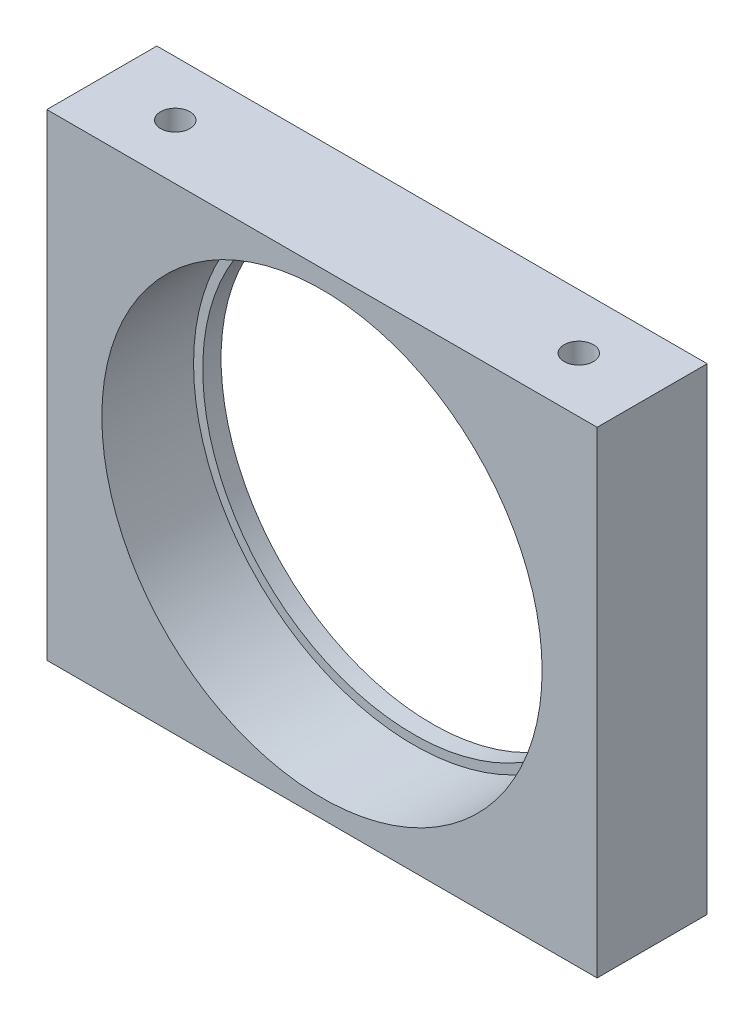
ISO-10303-21;
HEADER;
FILE_DESCRIPTION(('STEP AP214'),'2;1');
FILE_NAME('part.step','',(''),(''),'','','');
FILE_SCHEMA(('AUTOMOTIVE_DESIGN { 1 0 10303 214 1 1 1 1 }'));
ENDSEC;
DATA;
#1=APPLICATION_CONTEXT('core data for automotive mechanical design processes');
#2=APPLICATION_PROTOCOL_DEFINITION('international standard','automotive_design',2000,#1);
#3=PRODUCT_CONTEXT('',#1,'mechanical');
#4=PRODUCT('Part','Part','',(#3));
#5=PRODUCT_RELATED_PRODUCT_CATEGORY('part','',(#4));
#6=PRODUCT_DEFINITION_FORMATION('','',#4);
#7=PRODUCT_DEFINITION_CONTEXT('part definition',#1,'design');
#8=PRODUCT_DEFINITION('design','',#6,#7);
#9=PRODUCT_DEFINITION_SHAPE('','',#8);
#10=(LENGTH_UNIT() NAMED_UNIT(*) SI_UNIT(.MILLI.,.METRE.));
#11=(NAMED_UNIT(*) PLANE_ANGLE_UNIT() SI_UNIT($,.RADIAN.));
#12=(NAMED_UNIT(*) SI_UNIT($,.STERADIAN.) SOLID_ANGLE_UNIT());
#13=UNCERTAINTY_MEASURE_WITH_UNIT(LENGTH_MEASURE(1.E-05),#10,'distance_accuracy_value','');
#14=(GEOMETRIC_REPRESENTATION_CONTEXT(3) GLOBAL_UNCERTAINTY_ASSIGNED_CONTEXT((#13)) GLOBAL_UNIT_ASSIGNED_CONTEXT((#10,
#11,#12)) REPRESENTATION_CONTEXT('',''));
#15=CARTESIAN_POINT('',(0.,0.,0.));
#16=DIRECTION('',(0.,0.,1.));
#17=DIRECTION('',(1.,0.,0.));
#18=AXIS2_PLACEMENT_3D('',#15,#16,#17);
#19=CARTESIAN_POINT('',(15.,13.,6.));
#20=DIRECTION('',(0.,0.,-1.));
#21=DIRECTION('',(-1.,0.,0.));
#22=AXIS2_PLACEMENT_3D('',#19,#20,#21);
#23=CYLINDRICAL_SURFACE('',#22,11.5);
#24=CARTESIAN_POINT('',(15.,13.,0.));
#25=DIRECTION('',(0.,0.,1.));
#26=DIRECTION('',(1.,0.,0.));
#27=AXIS2_PLACEMENT_3D('',#24,#25,#26);
#28=CIRCLE('',#27,11.5);
#29=CARTESIAN_POINT('',(26.5,13.,0.));
#30=VERTEX_POINT('',#29);
#31=EDGE_CURVE('E133',#30,#30,#28,.T.);
#32=ORIENTED_EDGE('',*,*,#31,.F.);
#33=EDGE_LOOP('',(#32));
#34=FACE_BOUND('',#33,.T.);
#35=CARTESIAN_POINT('',(15.,13.,1.));
#36=DIRECTION('',(0.,0.,1.));
#37=DIRECTION('',(1.,0.,0.));
#38=AXIS2_PLACEMENT_3D('',#35,#36,#37);
#39=CIRCLE('',#38,11.5);
#40=CARTESIAN_POINT('',(26.5,13.,1.));
#41=VERTEX_POINT('',#40);
#42=EDGE_CURVE('E36',#41,#41,#39,.T.);
#43=ORIENTED_EDGE('',*,*,#42,.T.);
#44=EDGE_LOOP('',(#43));
#45=FACE_BOUND('',#44,.T.);
#46=ADVANCED_FACE('F32',(#34,#45),#23,.F.);
#47=CARTESIAN_POINT('',(0.,0.,6.));
#48=DIRECTION('',(0.,0.,-1.));
#49=DIRECTION('',(-1.,0.,0.));
#50=AXIS2_PLACEMENT_3D('',#47,#48,#49);
#51=PLANE('',#50);
#52=CARTESIAN_POINT('',(15.,13.,6.));
#53=DIRECTION('',(0.,0.,1.));
#54=DIRECTION('',(1.,0.,0.));
#55=AXIS2_PLACEMENT_3D('',#52,#53,#54);
#56=CIRCLE('',#55,12.);
#57=CARTESIAN_POINT('',(27.,13.,6.));
#58=VERTEX_POINT('',#57);
#59=EDGE_CURVE('E127',#58,#58,#56,.T.);
#60=ORIENTED_EDGE('',*,*,#59,.F.);
#61=EDGE_LOOP('',(#60));
#62=FACE_BOUND('',#61,.T.);
#63=DIRECTION('',(0.,-1.,0.));
#64=VECTOR('',#63,1.);
#65=CARTESIAN_POINT('',(0.,0.,6.));
#66=LINE('',#65,#64);
#67=CARTESIAN_POINT('',(0.,26.,6.));
#68=VERTEX_POINT('',#67);
#69=CARTESIAN_POINT('',(0.,0.,6.));
#70=VERTEX_POINT('',#69);
#71=EDGE_CURVE('E137',#68,#70,#66,.T.);
#72=ORIENTED_EDGE('',*,*,#71,.T.);
#73=DIRECTION('',(1.,0.,0.));
#74=VECTOR('',#73,1.);
#75=CARTESIAN_POINT('',(0.,0.,6.));
#76=LINE('',#75,#74);
#77=CARTESIAN_POINT('',(30.,0.,6.));
#78=VERTEX_POINT('',#77);
#79=EDGE_CURVE('E81',#70,#78,#76,.T.);
#80=ORIENTED_EDGE('',*,*,#79,.T.);
#81=DIRECTION('',(0.,1.,0.));
#82=VECTOR('',#81,1.);
#83=CARTESIAN_POINT('',(30.,0.,6.));
#84=LINE('',#83,#82);
#85=CARTESIAN_POINT('',(30.,26.,6.));
#86=VERTEX_POINT('',#85);
#87=EDGE_CURVE('E140',#78,#86,#84,.T.);
#88=ORIENTED_EDGE('',*,*,#87,.T.);
#89=DIRECTION('',(-1.,0.,0.));
#90=VECTOR('',#89,1.);
#91=CARTESIAN_POINT('',(0.,26.,6.));
#92=LINE('',#91,#90);
#93=EDGE_CURVE('E50',#86,#68,#92,.T.);
#94=ORIENTED_EDGE('',*,*,#93,.T.);
#95=EDGE_LOOP('',(#72,#80,#88,#94));
#96=FACE_BOUND('',#95,.T.);
#97=ADVANCED_FACE('F180',(#62,#96),#51,.F.);
#98=CARTESIAN_POINT('',(0.,0.,0.));
#99=DIRECTION('',(0.,0.,-1.));
#100=DIRECTION('',(-1.,0.,0.));
#101=AXIS2_PLACEMENT_3D('',#98,#99,#100);
#102=PLANE('',#101);
#103=DIRECTION('',(0.,-1.,0.));
#104=VECTOR('',#103,1.);
#105=CARTESIAN_POINT('',(0.,0.,0.));
#106=LINE('',#105,#104);
#107=CARTESIAN_POINT('',(0.,26.,0.));
#108=VERTEX_POINT('',#107);
#109=CARTESIAN_POINT('',(0.,0.,0.));
#110=VERTEX_POINT('',#109);
#111=EDGE_CURVE('E136',#108,#110,#106,.T.);
#112=ORIENTED_EDGE('',*,*,#111,.F.);
#113=DIRECTION('',(-1.,0.,0.));
#114=VECTOR('',#113,1.);
#115=CARTESIAN_POINT('',(0.,26.,0.));
#116=LINE('',#115,#114);
#117=CARTESIAN_POINT('',(30.,26.,0.));
#118=VERTEX_POINT('',#117);
#119=EDGE_CURVE('E74',#118,#108,#116,.T.);
#120=ORIENTED_EDGE('',*,*,#119,.F.);
#121=DIRECTION('',(0.,1.,0.));
#122=VECTOR('',#121,1.);
#123=CARTESIAN_POINT('',(30.,0.,0.));
#124=LINE('',#123,#122);
#125=CARTESIAN_POINT('',(30.,0.,0.));
#126=VERTEX_POINT('',#125);
#127=EDGE_CURVE('E68',#126,#118,#124,.T.);
#128=ORIENTED_EDGE('',*,*,#127,.F.);
#129=DIRECTION('',(1.,0.,0.));
#130=VECTOR('',#129,1.);
#131=CARTESIAN_POINT('',(0.,0.,0.));
#132=LINE('',#131,#130);
#133=EDGE_CURVE('E146',#110,#126,#132,.T.);
#134=ORIENTED_EDGE('',*,*,#133,.F.);
#135=EDGE_LOOP('',(#112,#120,#128,#134));
#136=FACE_BOUND('',#135,.T.);
#137=ORIENTED_EDGE('',*,*,#31,.T.);
#138=EDGE_LOOP('',(#137));
#139=FACE_BOUND('',#138,.T.);
#140=ADVANCED_FACE('F157',(#136,#139),#102,.T.);
#141=CARTESIAN_POINT('',(0.,0.,6.));
#142=DIRECTION('',(1.,0.,0.));
#143=DIRECTION('',(0.,0.,-1.));
#144=AXIS2_PLACEMENT_3D('',#141,#142,#143);
#145=PLANE('',#144);
#146=ORIENTED_EDGE('',*,*,#111,.T.);
#147=DIRECTION('',(0.,0.,-1.));
#148=VECTOR('',#147,1.);
#149=CARTESIAN_POINT('',(0.,0.,6.));
#150=LINE('',#149,#148);
#151=EDGE_CURVE('E11',#70,#110,#150,.T.);
#152=ORIENTED_EDGE('',*,*,#151,.F.);
#153=ORIENTED_EDGE('',*,*,#71,.F.);
#154=DIRECTION('',(0.,0.,-1.));
#155=VECTOR('',#154,1.);
#156=CARTESIAN_POINT('',(0.,26.,6.));
#157=LINE('',#156,#155);
#158=EDGE_CURVE('E143',#68,#108,#157,.T.);
#159=ORIENTED_EDGE('',*,*,#158,.T.);
#160=EDGE_LOOP('',(#146,#152,#153,#159));
#161=FACE_BOUND('',#160,.T.);
#162=ADVANCED_FACE('F34',(#161),#145,.F.);
#163=CARTESIAN_POINT('',(0.,0.,6.));
#164=DIRECTION('',(0.,1.,0.));
#165=DIRECTION('',(0.,0.,1.));
#166=AXIS2_PLACEMENT_3D('',#163,#164,#165);
#167=PLANE('',#166);
#168=CARTESIAN_POINT('',(4.,0.,3.));
#169=DIRECTION('',(0.,-1.,0.));
#170=DIRECTION('',(0.,0.,-1.));
#171=AXIS2_PLACEMENT_3D('',#168,#169,#170);
#172=CIRCLE('',#171,0.79999999999999);
#173=CARTESIAN_POINT('',(4.,0.,2.20000000000001));
#174=VERTEX_POINT('',#173);
#175=EDGE_CURVE('E105',#174,#174,#172,.T.);
#176=ORIENTED_EDGE('',*,*,#175,.F.);
#177=EDGE_LOOP('',(#176));
#178=FACE_BOUND('',#177,.T.);
#179=CARTESIAN_POINT('',(26.,0.,3.));
#180=DIRECTION('',(0.,-1.,0.));
#181=DIRECTION('',(0.,0.,-1.));
#182=AXIS2_PLACEMENT_3D('',#179,#180,#181);
#183=CIRCLE('',#182,0.799999999999992);
#184=CARTESIAN_POINT('',(26.,0.,2.20000000000001));
#185=VERTEX_POINT('',#184);
#186=EDGE_CURVE('E104',#185,#185,#183,.T.);
#187=ORIENTED_EDGE('',*,*,#186,.F.);
#188=EDGE_LOOP('',(#187));
#189=FACE_BOUND('',#188,.T.);
#190=ORIENTED_EDGE('',*,*,#133,.T.);
#191=DIRECTION('',(0.,0.,-1.));
#192=VECTOR('',#191,1.);
#193=CARTESIAN_POINT('',(30.,0.,6.));
#194=LINE('',#193,#192);
#195=EDGE_CURVE('E42',#78,#126,#194,.T.);
#196=ORIENTED_EDGE('',*,*,#195,.F.);
#197=ORIENTED_EDGE('',*,*,#79,.F.);
#198=ORIENTED_EDGE('',*,*,#151,.T.);
#199=EDGE_LOOP('',(#190,#196,#197,#198));
#200=FACE_BOUND('',#199,.T.);
#201=ADVANCED_FACE('F174',(#178,#189,#200),#167,.F.);
#202=CARTESIAN_POINT('',(30.,0.,6.));
#203=DIRECTION('',(-1.,0.,0.));
#204=DIRECTION('',(0.,0.,1.));
#205=AXIS2_PLACEMENT_3D('',#202,#203,#204);
#206=PLANE('',#205);
#207=ORIENTED_EDGE('',*,*,#127,.T.);
#208=DIRECTION('',(0.,0.,-1.));
#209=VECTOR('',#208,1.);
#210=CARTESIAN_POINT('',(30.,26.,6.));
#211=LINE('',#210,#209);
#212=EDGE_CURVE('E151',#86,#118,#211,.T.);
#213=ORIENTED_EDGE('',*,*,#212,.F.);
#214=ORIENTED_EDGE('',*,*,#87,.F.);
#215=ORIENTED_EDGE('',*,*,#195,.T.);
#216=EDGE_LOOP('',(#207,#213,#214,#215));
#217=FACE_BOUND('',#216,.T.);
#218=ADVANCED_FACE('F154',(#217),#206,.F.);
#219=CARTESIAN_POINT('',(0.,26.,6.));
#220=DIRECTION('',(0.,-1.,0.));
#221=DIRECTION('',(0.,0.,-1.));
#222=AXIS2_PLACEMENT_3D('',#219,#220,#221);
#223=PLANE('',#222);
#224=CARTESIAN_POINT('',(4.,26.,3.));
#225=DIRECTION('',(0.,1.,0.));
#226=DIRECTION('',(0.,0.,1.));
#227=AXIS2_PLACEMENT_3D('',#224,#225,#226);
#228=CIRCLE('',#227,0.79999999999999);
#229=CARTESIAN_POINT('',(4.,26.,3.79999999999999));
#230=VERTEX_POINT('',#229);
#231=EDGE_CURVE('E115',#230,#230,#228,.T.);
#232=ORIENTED_EDGE('',*,*,#231,.F.);
#233=EDGE_LOOP('',(#232));
#234=FACE_BOUND('',#233,.T.);
#235=CARTESIAN_POINT('',(26.,26.,3.));
#236=DIRECTION('',(0.,1.,0.));
#237=DIRECTION('',(0.,0.,1.));
#238=AXIS2_PLACEMENT_3D('',#235,#236,#237);
#239=CIRCLE('',#238,0.799999999999992);
#240=CARTESIAN_POINT('',(26.,26.,3.79999999999999));
#241=VERTEX_POINT('',#240);
#242=EDGE_CURVE('E121',#241,#241,#239,.T.);
#243=ORIENTED_EDGE('',*,*,#242,.F.);
#244=EDGE_LOOP('',(#243));
#245=FACE_BOUND('',#244,.T.);
#246=ORIENTED_EDGE('',*,*,#119,.T.);
#247=ORIENTED_EDGE('',*,*,#158,.F.);
#248=ORIENTED_EDGE('',*,*,#93,.F.);
#249=ORIENTED_EDGE('',*,*,#212,.T.);
#250=EDGE_LOOP('',(#246,#247,#248,#249));
#251=FACE_BOUND('',#250,.T.);
#252=ADVANCED_FACE('F162',(#234,#245,#251),#223,.F.);
#253=CARTESIAN_POINT('',(15.,13.,1.));
#254=DIRECTION('',(0.,0.,1.));
#255=DIRECTION('',(1.,0.,0.));
#256=AXIS2_PLACEMENT_3D('',#253,#254,#255);
#257=CYLINDRICAL_SURFACE('',#256,12.);
#258=CARTESIAN_POINT('',(15.,13.,1.));
#259=DIRECTION('',(0.,0.,1.));
#260=DIRECTION('',(1.,0.,0.));
#261=AXIS2_PLACEMENT_3D('',#258,#259,#260);
#262=CIRCLE('',#261,12.);
#263=CARTESIAN_POINT('',(27.,13.,1.));
#264=VERTEX_POINT('',#263);
#265=EDGE_CURVE('E128',#264,#264,#262,.T.);
#266=ORIENTED_EDGE('',*,*,#265,.F.);
#267=EDGE_LOOP('',(#266));
#268=FACE_BOUND('',#267,.T.);
#269=ORIENTED_EDGE('',*,*,#59,.T.);
#270=EDGE_LOOP('',(#269));
#271=FACE_BOUND('',#270,.T.);
#272=ADVANCED_FACE('F164',(#268,#271),#257,.F.);
#273=CARTESIAN_POINT('',(15.,13.,1.));
#274=DIRECTION('',(0.,0.,1.));
#275=DIRECTION('',(1.,0.,0.));
#276=AXIS2_PLACEMENT_3D('',#273,#274,#275);
#277=PLANE('',#276);
#278=ORIENTED_EDGE('',*,*,#42,.F.);
#279=EDGE_LOOP('',(#278));
#280=FACE_BOUND('',#279,.T.);
#281=ORIENTED_EDGE('',*,*,#265,.T.);
#282=EDGE_LOOP('',(#281));
#283=FACE_BOUND('',#282,.T.);
#284=ADVANCED_FACE('F171',(#280,#283),#277,.T.);
#285=CARTESIAN_POINT('',(26.,21.,3.));
#286=DIRECTION('',(0.,1.,0.));
#287=DIRECTION('',(0.,0.,1.));
#288=AXIS2_PLACEMENT_3D('',#285,#286,#287);
#289=CONICAL_SURFACE('',#288,0.799999999999999,1.02974425867665);
#290=CARTESIAN_POINT('',(26.,20.5193115047779,3.));
#291=VERTEX_POINT('',#290);
#292=VERTEX_LOOP('',#291);
#293=FACE_BOUND('',#292,.T.);
#294=CARTESIAN_POINT('',(26.,21.,3.));
#295=DIRECTION('',(0.,1.,0.));
#296=DIRECTION('',(0.,0.,1.));
#297=AXIS2_PLACEMENT_3D('',#294,#295,#296);
#298=CIRCLE('',#297,0.799999999999999);
#299=CARTESIAN_POINT('',(26.,21.,3.8));
#300=VERTEX_POINT('',#299);
#301=EDGE_CURVE('E124',#300,#300,#298,.T.);
#302=ORIENTED_EDGE('',*,*,#301,.T.);
#303=EDGE_LOOP('',(#302));
#304=FACE_BOUND('',#303,.T.);
#305=ADVANCED_FACE('F228',(#293,#304),#289,.F.);
#306=CARTESIAN_POINT('',(26.,26.,3.));
#307=DIRECTION('',(0.,1.,0.));
#308=DIRECTION('',(0.,0.,1.));
#309=AXIS2_PLACEMENT_3D('',#306,#307,#308);
#310=CYLINDRICAL_SURFACE('',#309,0.799999999999995);
#311=ORIENTED_EDGE('',*,*,#301,.F.);
#312=EDGE_LOOP('',(#311));
#313=FACE_BOUND('',#312,.T.);
#314=ORIENTED_EDGE('',*,*,#242,.T.);
#315=EDGE_LOOP('',(#314));
#316=FACE_BOUND('',#315,.T.);
#317=ADVANCED_FACE('F224',(#313,#316),#310,.F.);
#318=CARTESIAN_POINT('',(4.,21.,3.));
#319=DIRECTION('',(0.,1.,0.));
#320=DIRECTION('',(0.,0.,1.));
#321=AXIS2_PLACEMENT_3D('',#318,#319,#320);
#322=CONICAL_SURFACE('',#321,0.799999999999999,1.02974425867665);
#323=CARTESIAN_POINT('',(4.,20.5193115047779,3.));
#324=VERTEX_POINT('',#323);
#325=VERTEX_LOOP('',#324);
#326=FACE_BOUND('',#325,.T.);
#327=CARTESIAN_POINT('',(4.,21.,3.));
#328=DIRECTION('',(0.,1.,0.));
#329=DIRECTION('',(0.,0.,1.));
#330=AXIS2_PLACEMENT_3D('',#327,#328,#329);
#331=CIRCLE('',#330,0.799999999999999);
#332=CARTESIAN_POINT('',(4.,21.,3.8));
#333=VERTEX_POINT('',#332);
#334=EDGE_CURVE('E118',#333,#333,#331,.T.);
#335=ORIENTED_EDGE('',*,*,#334,.T.);
#336=EDGE_LOOP('',(#335));
#337=FACE_BOUND('',#336,.T.);
#338=ADVANCED_FACE('F220',(#326,#337),#322,.F.);
#339=CARTESIAN_POINT('',(4.,26.,3.));
#340=DIRECTION('',(0.,1.,0.));
#341=DIRECTION('',(0.,0.,1.));
#342=AXIS2_PLACEMENT_3D('',#339,#340,#341);
#343=CYLINDRICAL_SURFACE('',#342,0.799999999999994);
#344=ORIENTED_EDGE('',*,*,#334,.F.);
#345=EDGE_LOOP('',(#344));
#346=FACE_BOUND('',#345,.T.);
#347=ORIENTED_EDGE('',*,*,#231,.T.);
#348=EDGE_LOOP('',(#347));
#349=FACE_BOUND('',#348,.T.);
#350=ADVANCED_FACE('F212',(#346,#349),#343,.F.);
#351=CARTESIAN_POINT('',(26.,5.,3.));
#352=DIRECTION('',(0.,-1.,0.));
#353=DIRECTION('',(0.,0.,-1.));
#354=AXIS2_PLACEMENT_3D('',#351,#352,#353);
#355=CONICAL_SURFACE('',#354,0.799999999999988,1.02974425867665);
#356=CARTESIAN_POINT('',(26.,5.48068849522205,3.));
#357=VERTEX_POINT('',#356);
#358=VERTEX_LOOP('',#357);
#359=FACE_BOUND('',#358,.T.);
#360=CARTESIAN_POINT('',(26.,5.,3.));
#361=DIRECTION('',(0.,-1.,0.));
#362=DIRECTION('',(0.,0.,-1.));
#363=AXIS2_PLACEMENT_3D('',#360,#361,#362);
#364=CIRCLE('',#363,0.799999999999988);
#365=CARTESIAN_POINT('',(26.,5.,2.20000000000001));
#366=VERTEX_POINT('',#365);
#367=EDGE_CURVE('E108',#366,#366,#364,.T.);
#368=ORIENTED_EDGE('',*,*,#367,.T.);
#369=EDGE_LOOP('',(#368));
#370=FACE_BOUND('',#369,.T.);
#371=ADVANCED_FACE('F206',(#359,#370),#355,.F.);
#372=CARTESIAN_POINT('',(26.,0.,3.));
#373=DIRECTION('',(0.,-1.,0.));
#374=DIRECTION('',(0.,0.,-1.));
#375=AXIS2_PLACEMENT_3D('',#372,#373,#374);
#376=CYLINDRICAL_SURFACE('',#375,0.79999999999999);
#377=ORIENTED_EDGE('',*,*,#367,.F.);
#378=EDGE_LOOP('',(#377));
#379=FACE_BOUND('',#378,.T.);
#380=ORIENTED_EDGE('',*,*,#186,.T.);
#381=EDGE_LOOP('',(#380));
#382=FACE_BOUND('',#381,.T.);
#383=ADVANCED_FACE('F98',(#379,#382),#376,.F.);
#384=CARTESIAN_POINT('',(4.,5.,3.));
#385=DIRECTION('',(0.,-1.,0.));
#386=DIRECTION('',(0.,0.,-1.));
#387=AXIS2_PLACEMENT_3D('',#384,#385,#386);
#388=CONICAL_SURFACE('',#387,0.799999999999988,1.02974425867665);
#389=CARTESIAN_POINT('',(4.,5.48068849522205,3.));
#390=VERTEX_POINT('',#389);
#391=VERTEX_LOOP('',#390);
#392=FACE_BOUND('',#391,.T.);
#393=CARTESIAN_POINT('',(4.,5.,3.));
#394=DIRECTION('',(0.,-1.,0.));
#395=DIRECTION('',(0.,0.,-1.));
#396=AXIS2_PLACEMENT_3D('',#393,#394,#395);
#397=CIRCLE('',#396,0.799999999999988);
#398=CARTESIAN_POINT('',(4.,5.,2.20000000000001));
#399=VERTEX_POINT('',#398);
#400=EDGE_CURVE('E102',#399,#399,#397,.T.);
#401=ORIENTED_EDGE('',*,*,#400,.T.);
#402=EDGE_LOOP('',(#401));
#403=FACE_BOUND('',#402,.T.);
#404=ADVANCED_FACE('F94',(#392,#403),#388,.F.);
#405=CARTESIAN_POINT('',(4.,0.,3.));
#406=DIRECTION('',(0.,-1.,0.));
#407=DIRECTION('',(0.,0.,-1.));
#408=AXIS2_PLACEMENT_3D('',#405,#406,#407);
#409=CYLINDRICAL_SURFACE('',#408,0.799999999999989);
#410=ORIENTED_EDGE('',*,*,#400,.F.);
#411=EDGE_LOOP('',(#410));
#412=FACE_BOUND('',#411,.T.);
#413=ORIENTED_EDGE('',*,*,#175,.T.);
#414=EDGE_LOOP('',(#413));
#415=FACE_BOUND('',#414,.T.);
#416=ADVANCED_FACE('F97',(#412,#415),#409,.F.);
#417=CLOSED_SHELL('',(#46,#97,#140,#162,#201,#218,#252,#272,#284,#305,#317,#338,#350,#371,#383,
#404,#416));
#418=MANIFOLD_SOLID_BREP('B2',#417);
#419=ADVANCED_BREP_SHAPE_REPRESENTATION('',(#18,#418),#14);
#420=SHAPE_DEFINITION_REPRESENTATION(#9,#419);
ENDSEC;
END-ISO-10303-21;
